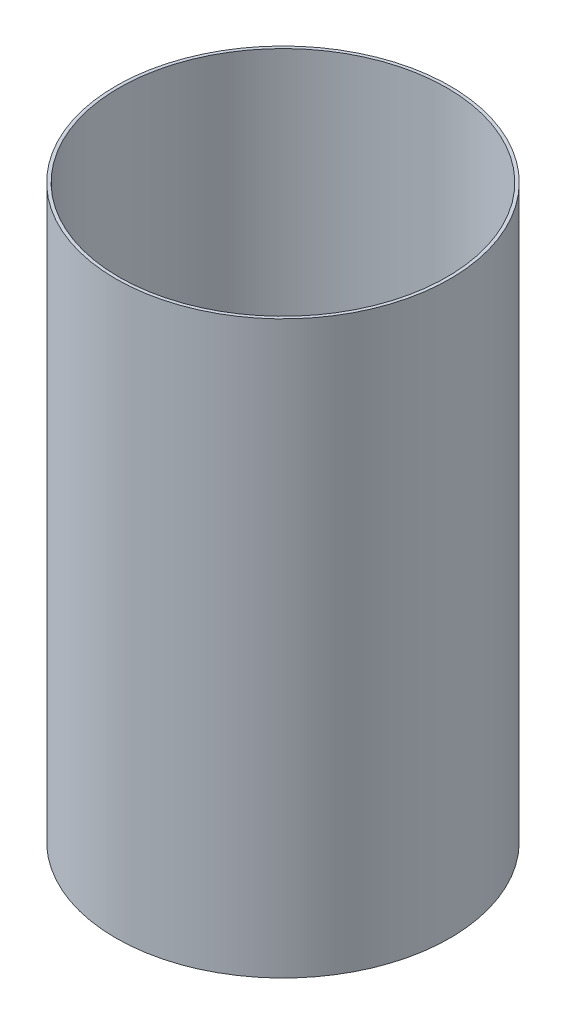
ISO-10303-21;
HEADER;
FILE_DESCRIPTION(('STEP AP214'),'2;1');
FILE_NAME('part.step','',(''),(''),'','','');
FILE_SCHEMA(('AUTOMOTIVE_DESIGN { 1 0 10303 214 1 1 1 1 }'));
ENDSEC;
DATA;
#1=APPLICATION_CONTEXT('core data for automotive mechanical design processes');
#2=APPLICATION_PROTOCOL_DEFINITION('international standard','automotive_design',2000,#1);
#3=PRODUCT_CONTEXT('',#1,'mechanical');
#4=PRODUCT('Part','Part','',(#3));
#5=PRODUCT_RELATED_PRODUCT_CATEGORY('part','',(#4));
#6=PRODUCT_DEFINITION_FORMATION('','',#4);
#7=PRODUCT_DEFINITION_CONTEXT('part definition',#1,'design');
#8=PRODUCT_DEFINITION('design','',#6,#7);
#9=PRODUCT_DEFINITION_SHAPE('','',#8);
#10=(LENGTH_UNIT() NAMED_UNIT(*) SI_UNIT(.MILLI.,.METRE.));
#11=(NAMED_UNIT(*) PLANE_ANGLE_UNIT() SI_UNIT($,.RADIAN.));
#12=(NAMED_UNIT(*) SI_UNIT($,.STERADIAN.) SOLID_ANGLE_UNIT());
#13=UNCERTAINTY_MEASURE_WITH_UNIT(LENGTH_MEASURE(1.E-05),#10,'distance_accuracy_value','');
#14=(GEOMETRIC_REPRESENTATION_CONTEXT(3) GLOBAL_UNCERTAINTY_ASSIGNED_CONTEXT((#13)) GLOBAL_UNIT_ASSIGNED_CONTEXT((#10,
#11,#12)) REPRESENTATION_CONTEXT('',''));
#15=CARTESIAN_POINT('',(0.,0.,0.));
#16=DIRECTION('',(0.,0.,1.));
#17=DIRECTION('',(1.,0.,0.));
#18=AXIS2_PLACEMENT_3D('',#15,#16,#17);
#19=CARTESIAN_POINT('',(0.,113.03,0.));
#20=DIRECTION('',(0.,1.,0.));
#21=DIRECTION('',(0.,0.,1.));
#22=AXIS2_PLACEMENT_3D('',#19,#20,#21);
#23=PLANE('',#22);
#24=CARTESIAN_POINT('',(0.,113.03,0.));
#25=DIRECTION('',(0.,1.,0.));
#26=DIRECTION('',(0.,0.,1.));
#27=AXIS2_PLACEMENT_3D('',#24,#25,#26);
#28=CIRCLE('',#27,33.0835);
#29=CARTESIAN_POINT('',(0.,113.03,33.0835));
#30=VERTEX_POINT('',#29);
#31=EDGE_CURVE('E10',#30,#30,#28,.T.);
#32=ORIENTED_EDGE('',*,*,#31,.T.);
#33=EDGE_LOOP('',(#32));
#34=FACE_BOUND('',#33,.T.);
#35=CARTESIAN_POINT('',(0.,113.03,0.));
#36=DIRECTION('',(0.,1.,0.));
#37=DIRECTION('',(0.,0.,1.));
#38=AXIS2_PLACEMENT_3D('',#35,#36,#37);
#39=CIRCLE('',#38,32.4612);
#40=CARTESIAN_POINT('',(0.,113.03,32.4612));
#41=VERTEX_POINT('',#40);
#42=EDGE_CURVE('E45',#41,#41,#39,.T.);
#43=ORIENTED_EDGE('',*,*,#42,.F.);
#44=EDGE_LOOP('',(#43));
#45=FACE_BOUND('',#44,.T.);
#46=ADVANCED_FACE('F34',(#34,#45),#23,.T.);
#47=CARTESIAN_POINT('',(0.,0.,0.));
#48=DIRECTION('',(0.,1.,0.));
#49=DIRECTION('',(0.,0.,1.));
#50=AXIS2_PLACEMENT_3D('',#47,#48,#49);
#51=PLANE('',#50);
#52=CARTESIAN_POINT('',(0.,0.,0.));
#53=DIRECTION('',(0.,1.,0.));
#54=DIRECTION('',(0.,0.,1.));
#55=AXIS2_PLACEMENT_3D('',#52,#53,#54);
#56=CIRCLE('',#55,33.0835);
#57=CARTESIAN_POINT('',(0.,0.,33.0835));
#58=VERTEX_POINT('',#57);
#59=EDGE_CURVE('E38',#58,#58,#56,.T.);
#60=ORIENTED_EDGE('',*,*,#59,.F.);
#61=EDGE_LOOP('',(#60));
#62=FACE_BOUND('',#61,.T.);
#63=CARTESIAN_POINT('',(0.,0.,0.));
#64=DIRECTION('',(0.,1.,0.));
#65=DIRECTION('',(0.,0.,1.));
#66=AXIS2_PLACEMENT_3D('',#63,#64,#65);
#67=CIRCLE('',#66,32.4612);
#68=CARTESIAN_POINT('',(0.,0.,32.4612));
#69=VERTEX_POINT('',#68);
#70=EDGE_CURVE('E47',#69,#69,#67,.T.);
#71=ORIENTED_EDGE('',*,*,#70,.T.);
#72=EDGE_LOOP('',(#71));
#73=FACE_BOUND('',#72,.T.);
#74=ADVANCED_FACE('F57',(#62,#73),#51,.F.);
#75=CARTESIAN_POINT('',(0.,113.03,0.));
#76=DIRECTION('',(0.,-1.,0.));
#77=DIRECTION('',(0.,0.,-1.));
#78=AXIS2_PLACEMENT_3D('',#75,#76,#77);
#79=CYLINDRICAL_SURFACE('',#78,33.0835);
#80=ORIENTED_EDGE('',*,*,#31,.F.);
#81=EDGE_LOOP('',(#80));
#82=FACE_BOUND('',#81,.T.);
#83=ORIENTED_EDGE('',*,*,#59,.T.);
#84=EDGE_LOOP('',(#83));
#85=FACE_BOUND('',#84,.T.);
#86=ADVANCED_FACE('F36',(#82,#85),#79,.T.);
#87=CARTESIAN_POINT('',(0.,113.03,0.));
#88=DIRECTION('',(0.,-1.,0.));
#89=DIRECTION('',(0.,0.,-1.));
#90=AXIS2_PLACEMENT_3D('',#87,#88,#89);
#91=CYLINDRICAL_SURFACE('',#90,32.4612);
#92=ORIENTED_EDGE('',*,*,#42,.T.);
#93=EDGE_LOOP('',(#92));
#94=FACE_BOUND('',#93,.T.);
#95=ORIENTED_EDGE('',*,*,#70,.F.);
#96=EDGE_LOOP('',(#95));
#97=FACE_BOUND('',#96,.T.);
#98=ADVANCED_FACE('F53',(#94,#97),#91,.F.);
#99=CLOSED_SHELL('',(#46,#74,#86,#98));
#100=MANIFOLD_SOLID_BREP('B2',#99);
#101=ADVANCED_BREP_SHAPE_REPRESENTATION('',(#18,#100),#14);
#102=SHAPE_DEFINITION_REPRESENTATION(#9,#101);
ENDSEC;
END-ISO-10303-21;
